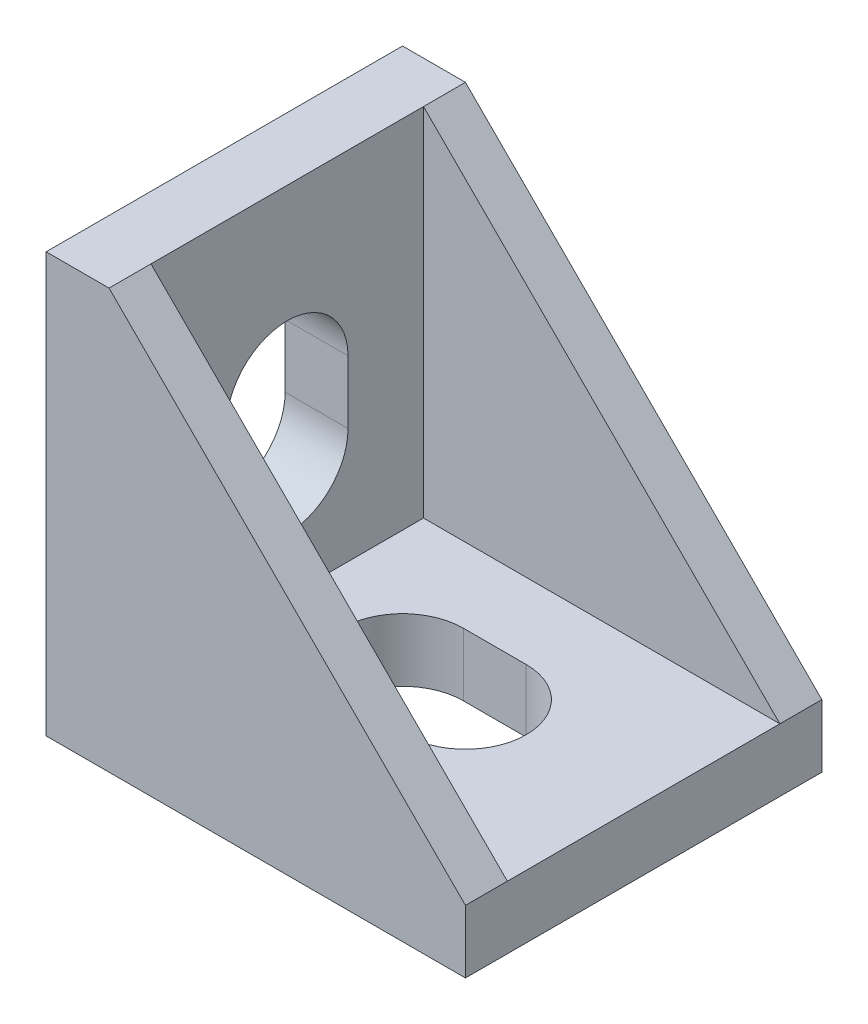
ISO-10303-21;
HEADER;
FILE_DESCRIPTION(('STEP AP214'),'2;1');
FILE_NAME('part.step','',(''),(''),'','','');
FILE_SCHEMA(('AUTOMOTIVE_DESIGN { 1 0 10303 214 1 1 1 1 }'));
ENDSEC;
DATA;
#1=APPLICATION_CONTEXT('core data for automotive mechanical design processes');
#2=APPLICATION_PROTOCOL_DEFINITION('international standard','automotive_design',2000,#1);
#3=PRODUCT_CONTEXT('',#1,'mechanical');
#4=PRODUCT('Part','Part','',(#3));
#5=PRODUCT_RELATED_PRODUCT_CATEGORY('part','',(#4));
#6=PRODUCT_DEFINITION_FORMATION('','',#4);
#7=PRODUCT_DEFINITION_CONTEXT('part definition',#1,'design');
#8=PRODUCT_DEFINITION('design','',#6,#7);
#9=PRODUCT_DEFINITION_SHAPE('','',#8);
#10=(LENGTH_UNIT() NAMED_UNIT(*) SI_UNIT(.MILLI.,.METRE.));
#11=(NAMED_UNIT(*) PLANE_ANGLE_UNIT() SI_UNIT($,.RADIAN.));
#12=(NAMED_UNIT(*) SI_UNIT($,.STERADIAN.) SOLID_ANGLE_UNIT());
#13=UNCERTAINTY_MEASURE_WITH_UNIT(LENGTH_MEASURE(1.E-05),#10,'distance_accuracy_value','');
#14=(GEOMETRIC_REPRESENTATION_CONTEXT(3) GLOBAL_UNCERTAINTY_ASSIGNED_CONTEXT((#13)) GLOBAL_UNIT_ASSIGNED_CONTEXT((#10,
#11,#12)) REPRESENTATION_CONTEXT('',''));
#15=CARTESIAN_POINT('',(0.,0.,0.));
#16=DIRECTION('',(0.,0.,1.));
#17=DIRECTION('',(1.,0.,0.));
#18=AXIS2_PLACEMENT_3D('',#15,#16,#17);
#19=CARTESIAN_POINT('',(0.,0.,8.5));
#20=DIRECTION('',(0.,1.,0.));
#21=DIRECTION('',(0.,0.,1.));
#22=AXIS2_PLACEMENT_3D('',#19,#20,#21);
#23=PLANE('',#22);
#24=DIRECTION('',(-1.,0.,0.));
#25=VECTOR('',#24,1.);
#26=CARTESIAN_POINT('',(1.5,0.,2.));
#27=LINE('',#26,#25);
#28=CARTESIAN_POINT('',(3.34999999999999,0.,2.));
#29=VERTEX_POINT('',#28);
#30=CARTESIAN_POINT('',(1.5,0.,2.));
#31=VERTEX_POINT('',#30);
#32=EDGE_CURVE('E293',#29,#31,#27,.T.);
#33=ORIENTED_EDGE('',*,*,#32,.F.);
#34=DIRECTION('',(0.,0.,-1.));
#35=VECTOR('',#34,1.);
#36=CARTESIAN_POINT('',(3.34999999999999,0.,2.));
#37=LINE('',#36,#35);
#38=CARTESIAN_POINT('',(3.34999999999999,0.,-2.));
#39=VERTEX_POINT('',#38);
#40=EDGE_CURVE('E304',#29,#39,#37,.T.);
#41=ORIENTED_EDGE('',*,*,#40,.T.);
#42=DIRECTION('',(-1.,0.,0.));
#43=VECTOR('',#42,1.);
#44=CARTESIAN_POINT('',(1.5,0.,-2.));
#45=LINE('',#44,#43);
#46=CARTESIAN_POINT('',(1.5,0.,-2.));
#47=VERTEX_POINT('',#46);
#48=EDGE_CURVE('E266',#39,#47,#45,.T.);
#49=ORIENTED_EDGE('',*,*,#48,.T.);
#50=DIRECTION('',(0.,0.,-1.));
#51=VECTOR('',#50,1.);
#52=CARTESIAN_POINT('',(1.5,0.,2.));
#53=LINE('',#52,#51);
#54=EDGE_CURVE('E60',#31,#47,#53,.T.);
#55=ORIENTED_EDGE('',*,*,#54,.F.);
#56=EDGE_LOOP('',(#33,#41,#49,#55));
#57=FACE_BOUND('',#56,.T.);
#58=DIRECTION('',(1.,0.,0.));
#59=VECTOR('',#58,1.);
#60=CARTESIAN_POINT('',(11.5,0.,2.9));
#61=LINE('',#60,#59);
#62=CARTESIAN_POINT('',(8.49999999999996,0.,2.9));
#63=VERTEX_POINT('',#62);
#64=CARTESIAN_POINT('',(11.5,0.,2.9));
#65=VERTEX_POINT('',#64);
#66=EDGE_CURVE('E405',#63,#65,#61,.T.);
#67=ORIENTED_EDGE('',*,*,#66,.T.);
#68=CARTESIAN_POINT('',(11.5,0.,0.));
#69=DIRECTION('',(0.,1.,0.));
#70=DIRECTION('',(-1.,0.,0.));
#71=AXIS2_PLACEMENT_3D('',#68,#69,#70);
#72=CIRCLE('',#71,2.9);
#73=CARTESIAN_POINT('',(11.5,0.,-2.9));
#74=VERTEX_POINT('',#73);
#75=EDGE_CURVE('E393',#65,#74,#72,.T.);
#76=ORIENTED_EDGE('',*,*,#75,.T.);
#77=DIRECTION('',(-1.,0.,0.));
#78=VECTOR('',#77,1.);
#79=CARTESIAN_POINT('',(11.5,0.,-2.9));
#80=LINE('',#79,#78);
#81=CARTESIAN_POINT('',(8.49999999999996,0.,-2.9));
#82=VERTEX_POINT('',#81);
#83=EDGE_CURVE('E396',#74,#82,#80,.T.);
#84=ORIENTED_EDGE('',*,*,#83,.T.);
#85=CARTESIAN_POINT('',(8.49999999999996,0.,0.));
#86=DIRECTION('',(0.,1.,0.));
#87=DIRECTION('',(-1.,0.,0.));
#88=AXIS2_PLACEMENT_3D('',#85,#86,#87);
#89=CIRCLE('',#88,2.9);
#90=EDGE_CURVE('E401',#82,#63,#89,.T.);
#91=ORIENTED_EDGE('',*,*,#90,.T.);
#92=EDGE_LOOP('',(#67,#76,#84,#91));
#93=FACE_BOUND('',#92,.T.);
#94=DIRECTION('',(1.,0.,0.));
#95=VECTOR('',#94,1.);
#96=CARTESIAN_POINT('',(0.,0.,-8.5));
#97=LINE('',#96,#95);
#98=CARTESIAN_POINT('',(0.,0.,-8.5));
#99=VERTEX_POINT('',#98);
#100=CARTESIAN_POINT('',(20.,0.,-8.5));
#101=VERTEX_POINT('',#100);
#102=EDGE_CURVE('E515',#99,#101,#97,.T.);
#103=ORIENTED_EDGE('',*,*,#102,.T.);
#104=DIRECTION('',(0.,0.,-1.));
#105=VECTOR('',#104,1.);
#106=CARTESIAN_POINT('',(20.,0.,8.5));
#107=LINE('',#106,#105);
#108=CARTESIAN_POINT('',(20.,0.,8.5));
#109=VERTEX_POINT('',#108);
#110=EDGE_CURVE('E531',#109,#101,#107,.T.);
#111=ORIENTED_EDGE('',*,*,#110,.F.);
#112=DIRECTION('',(1.,0.,0.));
#113=VECTOR('',#112,1.);
#114=CARTESIAN_POINT('',(0.,0.,8.5));
#115=LINE('',#114,#113);
#116=CARTESIAN_POINT('',(0.,0.,8.5));
#117=VERTEX_POINT('',#116);
#118=EDGE_CURVE('E502',#117,#109,#115,.T.);
#119=ORIENTED_EDGE('',*,*,#118,.F.);
#120=DIRECTION('',(0.,0.,-1.));
#121=VECTOR('',#120,1.);
#122=CARTESIAN_POINT('',(0.,0.,8.5));
#123=LINE('',#122,#121);
#124=EDGE_CURVE('E534',#117,#99,#123,.T.);
#125=ORIENTED_EDGE('',*,*,#124,.T.);
#126=EDGE_LOOP('',(#103,#111,#119,#125));
#127=FACE_BOUND('',#126,.T.);
#128=DIRECTION('',(-1.,0.,0.));
#129=VECTOR('',#128,1.);
#130=CARTESIAN_POINT('',(18.5,0.,2.));
#131=LINE('',#130,#129);
#132=CARTESIAN_POINT('',(18.5,0.,2.));
#133=VERTEX_POINT('',#132);
#134=CARTESIAN_POINT('',(16.65,0.,2.));
#135=VERTEX_POINT('',#134);
#136=EDGE_CURVE('E249',#133,#135,#131,.T.);
#137=ORIENTED_EDGE('',*,*,#136,.F.);
#138=DIRECTION('',(0.,0.,-1.));
#139=VECTOR('',#138,1.);
#140=CARTESIAN_POINT('',(18.5,0.,2.));
#141=LINE('',#140,#139);
#142=CARTESIAN_POINT('',(18.5,0.,-2.));
#143=VERTEX_POINT('',#142);
#144=EDGE_CURVE('E260',#133,#143,#141,.T.);
#145=ORIENTED_EDGE('',*,*,#144,.T.);
#146=DIRECTION('',(-1.,0.,0.));
#147=VECTOR('',#146,1.);
#148=CARTESIAN_POINT('',(18.5,0.,-2.));
#149=LINE('',#148,#147);
#150=CARTESIAN_POINT('',(16.65,0.,-2.));
#151=VERTEX_POINT('',#150);
#152=EDGE_CURVE('E281',#143,#151,#149,.T.);
#153=ORIENTED_EDGE('',*,*,#152,.T.);
#154=DIRECTION('',(0.,0.,-1.));
#155=VECTOR('',#154,1.);
#156=CARTESIAN_POINT('',(16.65,0.,2.));
#157=LINE('',#156,#155);
#158=EDGE_CURVE('E267',#135,#151,#157,.T.);
#159=ORIENTED_EDGE('',*,*,#158,.F.);
#160=EDGE_LOOP('',(#137,#145,#153,#159));
#161=FACE_BOUND('',#160,.T.);
#162=ADVANCED_FACE('F36',(#57,#93,#127,#161),#23,.F.);
#163=CARTESIAN_POINT('',(0.,20.,8.5));
#164=DIRECTION('',(1.,0.,0.));
#165=DIRECTION('',(0.,1.,0.));
#166=AXIS2_PLACEMENT_3D('',#163,#164,#165);
#167=PLANE('',#166);
#168=DIRECTION('',(0.,1.,0.));
#169=VECTOR('',#168,1.);
#170=CARTESIAN_POINT('',(0.,18.5,2.));
#171=LINE('',#170,#169);
#172=CARTESIAN_POINT('',(0.,16.65,2.));
#173=VERTEX_POINT('',#172);
#174=CARTESIAN_POINT('',(0.,18.5,2.));
#175=VERTEX_POINT('',#174);
#176=EDGE_CURVE('E359',#173,#175,#171,.T.);
#177=ORIENTED_EDGE('',*,*,#176,.F.);
#178=DIRECTION('',(0.,0.,-1.));
#179=VECTOR('',#178,1.);
#180=CARTESIAN_POINT('',(0.,16.65,2.));
#181=LINE('',#180,#179);
#182=CARTESIAN_POINT('',(0.,16.65,-2.));
#183=VERTEX_POINT('',#182);
#184=EDGE_CURVE('E371',#173,#183,#181,.T.);
#185=ORIENTED_EDGE('',*,*,#184,.T.);
#186=DIRECTION('',(0.,1.,0.));
#187=VECTOR('',#186,1.);
#188=CARTESIAN_POINT('',(0.,18.5,-2.));
#189=LINE('',#188,#187);
#190=CARTESIAN_POINT('',(0.,18.5,-2.));
#191=VERTEX_POINT('',#190);
#192=EDGE_CURVE('E358',#183,#191,#189,.T.);
#193=ORIENTED_EDGE('',*,*,#192,.T.);
#194=DIRECTION('',(0.,0.,-1.));
#195=VECTOR('',#194,1.);
#196=CARTESIAN_POINT('',(0.,18.5,2.));
#197=LINE('',#196,#195);
#198=EDGE_CURVE('E389',#175,#191,#197,.T.);
#199=ORIENTED_EDGE('',*,*,#198,.F.);
#200=EDGE_LOOP('',(#177,#185,#193,#199));
#201=FACE_BOUND('',#200,.T.);
#202=DIRECTION('',(0.,1.,0.));
#203=VECTOR('',#202,1.);
#204=CARTESIAN_POINT('',(0.,8.50000000000005,2.9));
#205=LINE('',#204,#203);
#206=CARTESIAN_POINT('',(0.,8.50000000000005,2.9));
#207=VERTEX_POINT('',#206);
#208=CARTESIAN_POINT('',(0.,11.5,2.9));
#209=VERTEX_POINT('',#208);
#210=EDGE_CURVE('E433',#207,#209,#205,.T.);
#211=ORIENTED_EDGE('',*,*,#210,.F.);
#212=CARTESIAN_POINT('',(0.,8.50000000000005,0.));
#213=DIRECTION('',(1.,0.,0.));
#214=DIRECTION('',(0.,1.,0.));
#215=AXIS2_PLACEMENT_3D('',#212,#213,#214);
#216=CIRCLE('',#215,2.9);
#217=CARTESIAN_POINT('',(0.,8.50000000000004,-2.9));
#218=VERTEX_POINT('',#217);
#219=EDGE_CURVE('E436',#218,#207,#216,.F.);
#220=ORIENTED_EDGE('',*,*,#219,.F.);
#221=DIRECTION('',(0.,-1.,0.));
#222=VECTOR('',#221,1.);
#223=CARTESIAN_POINT('',(0.,8.50000000000005,-2.9));
#224=LINE('',#223,#222);
#225=CARTESIAN_POINT('',(0.,11.5,-2.9));
#226=VERTEX_POINT('',#225);
#227=EDGE_CURVE('E457',#226,#218,#224,.T.);
#228=ORIENTED_EDGE('',*,*,#227,.F.);
#229=CARTESIAN_POINT('',(0.,11.5,0.));
#230=DIRECTION('',(1.,0.,0.));
#231=DIRECTION('',(0.,1.,0.));
#232=AXIS2_PLACEMENT_3D('',#229,#230,#231);
#233=CIRCLE('',#232,2.9);
#234=EDGE_CURVE('E423',#209,#226,#233,.F.);
#235=ORIENTED_EDGE('',*,*,#234,.F.);
#236=EDGE_LOOP('',(#211,#220,#228,#235));
#237=FACE_BOUND('',#236,.T.);
#238=DIRECTION('',(0.,-1.,0.));
#239=VECTOR('',#238,1.);
#240=CARTESIAN_POINT('',(0.,20.,-8.5));
#241=LINE('',#240,#239);
#242=CARTESIAN_POINT('',(0.,20.,-8.5));
#243=VERTEX_POINT('',#242);
#244=EDGE_CURVE('E512',#243,#99,#241,.T.);
#245=ORIENTED_EDGE('',*,*,#244,.T.);
#246=ORIENTED_EDGE('',*,*,#124,.F.);
#247=DIRECTION('',(0.,-1.,0.));
#248=VECTOR('',#247,1.);
#249=CARTESIAN_POINT('',(0.,20.,8.5));
#250=LINE('',#249,#248);
#251=CARTESIAN_POINT('',(0.,20.,8.5));
#252=VERTEX_POINT('',#251);
#253=EDGE_CURVE('E499',#252,#117,#250,.T.);
#254=ORIENTED_EDGE('',*,*,#253,.F.);
#255=DIRECTION('',(0.,0.,-1.));
#256=VECTOR('',#255,1.);
#257=CARTESIAN_POINT('',(0.,20.,8.5));
#258=LINE('',#257,#256);
#259=EDGE_CURVE('E538',#252,#243,#258,.T.);
#260=ORIENTED_EDGE('',*,*,#259,.T.);
#261=EDGE_LOOP('',(#245,#246,#254,#260));
#262=FACE_BOUND('',#261,.T.);
#263=DIRECTION('',(0.,1.,0.));
#264=VECTOR('',#263,1.);
#265=CARTESIAN_POINT('',(0.,1.5,2.));
#266=LINE('',#265,#264);
#267=CARTESIAN_POINT('',(0.,1.5,2.));
#268=VERTEX_POINT('',#267);
#269=CARTESIAN_POINT('',(0.,3.35,2.));
#270=VERTEX_POINT('',#269);
#271=EDGE_CURVE('E328',#268,#270,#266,.T.);
#272=ORIENTED_EDGE('',*,*,#271,.F.);
#273=DIRECTION('',(0.,0.,-1.));
#274=VECTOR('',#273,1.);
#275=CARTESIAN_POINT('',(0.,1.5,2.));
#276=LINE('',#275,#274);
#277=CARTESIAN_POINT('',(0.,1.5,-2.));
#278=VERTEX_POINT('',#277);
#279=EDGE_CURVE('E354',#268,#278,#276,.T.);
#280=ORIENTED_EDGE('',*,*,#279,.T.);
#281=DIRECTION('',(0.,1.,0.));
#282=VECTOR('',#281,1.);
#283=CARTESIAN_POINT('',(0.,1.5,-2.));
#284=LINE('',#283,#282);
#285=CARTESIAN_POINT('',(0.,3.35,-2.));
#286=VERTEX_POINT('',#285);
#287=EDGE_CURVE('E338',#278,#286,#284,.T.);
#288=ORIENTED_EDGE('',*,*,#287,.T.);
#289=DIRECTION('',(0.,0.,-1.));
#290=VECTOR('',#289,1.);
#291=CARTESIAN_POINT('',(0.,3.35,2.));
#292=LINE('',#291,#290);
#293=EDGE_CURVE('E350',#270,#286,#292,.T.);
#294=ORIENTED_EDGE('',*,*,#293,.F.);
#295=EDGE_LOOP('',(#272,#280,#288,#294));
#296=FACE_BOUND('',#295,.T.);
#297=ADVANCED_FACE('F598',(#201,#237,#262,#296),#167,.F.);
#298=CARTESIAN_POINT('',(20.,3.,8.5));
#299=DIRECTION('',(-0.707106781186547,-0.707106781186547,0.));
#300=DIRECTION('',(0.707106781186548,-0.707106781186548,0.));
#301=AXIS2_PLACEMENT_3D('',#298,#299,#300);
#302=PLANE('',#301);
#303=DIRECTION('',(0.,0.,-1.));
#304=VECTOR('',#303,1.);
#305=CARTESIAN_POINT('',(3.,20.,8.5));
#306=LINE('',#305,#304);
#307=CARTESIAN_POINT('',(3.,20.,-6.5));
#308=VERTEX_POINT('',#307);
#309=CARTESIAN_POINT('',(3.,20.,-8.5));
#310=VERTEX_POINT('',#309);
#311=EDGE_CURVE('E508',#308,#310,#306,.T.);
#312=ORIENTED_EDGE('',*,*,#311,.F.);
#313=DIRECTION('',(0.707106781186548,-0.707106781186548,0.));
#314=VECTOR('',#313,1.);
#315=CARTESIAN_POINT('',(20.,3.,-6.5));
#316=LINE('',#315,#314);
#317=CARTESIAN_POINT('',(20.,2.99999999999995,-6.5));
#318=VERTEX_POINT('',#317);
#319=EDGE_CURVE('E11',#308,#318,#316,.T.);
#320=ORIENTED_EDGE('',*,*,#319,.T.);
#321=DIRECTION('',(0.,0.,-1.));
#322=VECTOR('',#321,1.);
#323=CARTESIAN_POINT('',(20.,3.,8.5));
#324=LINE('',#323,#322);
#325=CARTESIAN_POINT('',(20.,3.,-8.5));
#326=VERTEX_POINT('',#325);
#327=EDGE_CURVE('E526',#318,#326,#324,.T.);
#328=ORIENTED_EDGE('',*,*,#327,.T.);
#329=DIRECTION('',(-0.707106781186548,0.707106781186548,0.));
#330=VECTOR('',#329,1.);
#331=CARTESIAN_POINT('',(20.,3.,-8.5));
#332=LINE('',#331,#330);
#333=EDGE_CURVE('E500',#326,#310,#332,.T.);
#334=ORIENTED_EDGE('',*,*,#333,.T.);
#335=EDGE_LOOP('',(#312,#320,#328,#334));
#336=FACE_BOUND('',#335,.T.);
#337=ADVANCED_FACE('F573',(#336),#302,.F.);
#338=CARTESIAN_POINT('',(3.,20.,8.5));
#339=DIRECTION('',(0.,-1.,0.));
#340=DIRECTION('',(1.,0.,0.));
#341=AXIS2_PLACEMENT_3D('',#338,#339,#340);
#342=PLANE('',#341);
#343=DIRECTION('',(-1.,0.,0.));
#344=VECTOR('',#343,1.);
#345=CARTESIAN_POINT('',(3.,20.,-8.5));
#346=LINE('',#345,#344);
#347=EDGE_CURVE('E492',#310,#243,#346,.T.);
#348=ORIENTED_EDGE('',*,*,#347,.T.);
#349=ORIENTED_EDGE('',*,*,#259,.F.);
#350=DIRECTION('',(-1.,0.,0.));
#351=VECTOR('',#350,1.);
#352=CARTESIAN_POINT('',(3.,20.,8.5));
#353=LINE('',#352,#351);
#354=CARTESIAN_POINT('',(3.,20.,8.5));
#355=VERTEX_POINT('',#354);
#356=EDGE_CURVE('E495',#355,#252,#353,.T.);
#357=ORIENTED_EDGE('',*,*,#356,.F.);
#358=CARTESIAN_POINT('',(3.,20.,6.5));
#359=VERTEX_POINT('',#358);
#360=EDGE_CURVE('E523',#355,#359,#306,.T.);
#361=ORIENTED_EDGE('',*,*,#360,.T.);
#362=DIRECTION('',(0.,0.,1.));
#363=VECTOR('',#362,1.);
#364=CARTESIAN_POINT('',(3.,20.,-6.5));
#365=LINE('',#364,#363);
#366=EDGE_CURVE('E470',#308,#359,#365,.T.);
#367=ORIENTED_EDGE('',*,*,#366,.F.);
#368=ORIENTED_EDGE('',*,*,#311,.T.);
#369=EDGE_LOOP('',(#348,#349,#357,#361,#367,#368));
#370=FACE_BOUND('',#369,.T.);
#371=ADVANCED_FACE('F38',(#370),#342,.F.);
#372=CARTESIAN_POINT('',(20.,0.,8.5));
#373=DIRECTION('',(-1.,0.,0.));
#374=DIRECTION('',(0.,-1.,0.));
#375=AXIS2_PLACEMENT_3D('',#372,#373,#374);
#376=PLANE('',#375);
#377=DIRECTION('',(0.,1.,0.));
#378=VECTOR('',#377,1.);
#379=CARTESIAN_POINT('',(20.,0.,-8.5));
#380=LINE('',#379,#378);
#381=EDGE_CURVE('E517',#101,#326,#380,.T.);
#382=ORIENTED_EDGE('',*,*,#381,.T.);
#383=ORIENTED_EDGE('',*,*,#327,.F.);
#384=DIRECTION('',(0.,0.,-1.));
#385=VECTOR('',#384,1.);
#386=CARTESIAN_POINT('',(20.,2.99999999999995,-6.5));
#387=LINE('',#386,#385);
#388=CARTESIAN_POINT('',(20.,2.99999999999995,6.5));
#389=VERTEX_POINT('',#388);
#390=EDGE_CURVE('E479',#389,#318,#387,.T.);
#391=ORIENTED_EDGE('',*,*,#390,.F.);
#392=CARTESIAN_POINT('',(20.,3.,8.5));
#393=VERTEX_POINT('',#392);
#394=EDGE_CURVE('E527',#393,#389,#324,.T.);
#395=ORIENTED_EDGE('',*,*,#394,.F.);
#396=DIRECTION('',(0.,1.,0.));
#397=VECTOR('',#396,1.);
#398=CARTESIAN_POINT('',(20.,0.,8.5));
#399=LINE('',#398,#397);
#400=EDGE_CURVE('E504',#109,#393,#399,.T.);
#401=ORIENTED_EDGE('',*,*,#400,.F.);
#402=ORIENTED_EDGE('',*,*,#110,.T.);
#403=EDGE_LOOP('',(#382,#383,#391,#395,#401,#402));
#404=FACE_BOUND('',#403,.T.);
#405=ADVANCED_FACE('F562',(#404),#376,.F.);
#406=ORIENTED_EDGE('',*,*,#394,.T.);
#407=DIRECTION('',(-0.707106781186548,0.707106781186548,0.));
#408=VECTOR('',#407,1.);
#409=CARTESIAN_POINT('',(20.,3.,6.5));
#410=LINE('',#409,#408);
#411=EDGE_CURVE('E45',#389,#359,#410,.T.);
#412=ORIENTED_EDGE('',*,*,#411,.T.);
#413=ORIENTED_EDGE('',*,*,#360,.F.);
#414=DIRECTION('',(-0.707106781186548,0.707106781186548,0.));
#415=VECTOR('',#414,1.);
#416=CARTESIAN_POINT('',(20.,3.,8.5));
#417=LINE('',#416,#415);
#418=EDGE_CURVE('E506',#393,#355,#417,.T.);
#419=ORIENTED_EDGE('',*,*,#418,.F.);
#420=EDGE_LOOP('',(#406,#412,#413,#419));
#421=FACE_BOUND('',#420,.T.);
#422=ADVANCED_FACE('F545',(#421),#302,.F.);
#423=CARTESIAN_POINT('',(0.,0.,8.5));
#424=DIRECTION('',(0.,0.,1.));
#425=DIRECTION('',(1.,0.,0.));
#426=AXIS2_PLACEMENT_3D('',#423,#424,#425);
#427=PLANE('',#426);
#428=ORIENTED_EDGE('',*,*,#356,.T.);
#429=ORIENTED_EDGE('',*,*,#253,.T.);
#430=ORIENTED_EDGE('',*,*,#118,.T.);
#431=ORIENTED_EDGE('',*,*,#400,.T.);
#432=ORIENTED_EDGE('',*,*,#418,.T.);
#433=EDGE_LOOP('',(#428,#429,#430,#431,#432));
#434=FACE_BOUND('',#433,.T.);
#435=ADVANCED_FACE('F555',(#434),#427,.T.);
#436=CARTESIAN_POINT('',(0.,0.,-8.5));
#437=DIRECTION('',(0.,0.,1.));
#438=DIRECTION('',(1.,0.,0.));
#439=AXIS2_PLACEMENT_3D('',#436,#437,#438);
#440=PLANE('',#439);
#441=ORIENTED_EDGE('',*,*,#347,.F.);
#442=ORIENTED_EDGE('',*,*,#333,.F.);
#443=ORIENTED_EDGE('',*,*,#381,.F.);
#444=ORIENTED_EDGE('',*,*,#102,.F.);
#445=ORIENTED_EDGE('',*,*,#244,.F.);
#446=EDGE_LOOP('',(#441,#442,#443,#444,#445));
#447=FACE_BOUND('',#446,.T.);
#448=ADVANCED_FACE('F646',(#447),#440,.F.);
#449=CARTESIAN_POINT('',(2.99999999999996,2.99999999999999,-6.5));
#450=DIRECTION('',(0.,0.,-1.));
#451=DIRECTION('',(-1.,0.,0.));
#452=AXIS2_PLACEMENT_3D('',#449,#450,#451);
#453=PLANE('',#452);
#454=DIRECTION('',(0.,1.,0.));
#455=VECTOR('',#454,1.);
#456=CARTESIAN_POINT('',(2.99999999999996,2.99999999999999,-6.5));
#457=LINE('',#456,#455);
#458=CARTESIAN_POINT('',(2.99999999999996,2.99999999999999,-6.5));
#459=VERTEX_POINT('',#458);
#460=EDGE_CURVE('E489',#459,#308,#457,.T.);
#461=ORIENTED_EDGE('',*,*,#460,.F.);
#462=DIRECTION('',(-1.,0.,0.));
#463=VECTOR('',#462,1.);
#464=CARTESIAN_POINT('',(2.99999999999996,2.99999999999999,-6.5));
#465=LINE('',#464,#463);
#466=EDGE_CURVE('E481',#318,#459,#465,.T.);
#467=ORIENTED_EDGE('',*,*,#466,.F.);
#468=ORIENTED_EDGE('',*,*,#319,.F.);
#469=EDGE_LOOP('',(#461,#467,#468));
#470=FACE_BOUND('',#469,.T.);
#471=ADVANCED_FACE('F569',(#470),#453,.F.);
#472=CARTESIAN_POINT('',(2.99999999999996,2.99999999999999,6.5));
#473=DIRECTION('',(0.,0.,1.));
#474=DIRECTION('',(1.,0.,0.));
#475=AXIS2_PLACEMENT_3D('',#472,#473,#474);
#476=PLANE('',#475);
#477=DIRECTION('',(1.,0.,0.));
#478=VECTOR('',#477,1.);
#479=CARTESIAN_POINT('',(2.99999999999996,2.99999999999999,6.5));
#480=LINE('',#479,#478);
#481=CARTESIAN_POINT('',(2.99999999999996,2.99999999999999,6.5));
#482=VERTEX_POINT('',#481);
#483=EDGE_CURVE('E475',#482,#389,#480,.T.);
#484=ORIENTED_EDGE('',*,*,#483,.F.);
#485=DIRECTION('',(0.,1.,0.));
#486=VECTOR('',#485,1.);
#487=CARTESIAN_POINT('',(2.99999999999996,2.99999999999999,6.5));
#488=LINE('',#487,#486);
#489=EDGE_CURVE('E485',#482,#359,#488,.T.);
#490=ORIENTED_EDGE('',*,*,#489,.T.);
#491=ORIENTED_EDGE('',*,*,#411,.F.);
#492=EDGE_LOOP('',(#484,#490,#491));
#493=FACE_BOUND('',#492,.T.);
#494=ADVANCED_FACE('F660',(#493),#476,.F.);
#495=CARTESIAN_POINT('',(2.99999999999996,2.99999999999999,-6.5));
#496=DIRECTION('',(-1.,0.,0.));
#497=DIRECTION('',(0.,-1.,0.));
#498=AXIS2_PLACEMENT_3D('',#495,#496,#497);
#499=PLANE('',#498);
#500=DIRECTION('',(0.,1.,0.));
#501=VECTOR('',#500,1.);
#502=CARTESIAN_POINT('',(2.99999999999998,8.50000000000004,-2.9));
#503=LINE('',#502,#501);
#504=CARTESIAN_POINT('',(2.99999999999998,8.50000000000004,-2.9));
#505=VERTEX_POINT('',#504);
#506=CARTESIAN_POINT('',(2.99999999999998,11.5,-2.9));
#507=VERTEX_POINT('',#506);
#508=EDGE_CURVE('E442',#505,#507,#503,.T.);
#509=ORIENTED_EDGE('',*,*,#508,.F.);
#510=CARTESIAN_POINT('',(2.99999999999998,8.50000000000004,0.));
#511=DIRECTION('',(1.,0.,0.));
#512=DIRECTION('',(0.,1.,0.));
#513=AXIS2_PLACEMENT_3D('',#510,#511,#512);
#514=CIRCLE('',#513,2.9);
#515=CARTESIAN_POINT('',(2.99999999999998,8.50000000000004,2.9));
#516=VERTEX_POINT('',#515);
#517=EDGE_CURVE('E440',#516,#505,#514,.T.);
#518=ORIENTED_EDGE('',*,*,#517,.F.);
#519=DIRECTION('',(0.,-1.,0.));
#520=VECTOR('',#519,1.);
#521=CARTESIAN_POINT('',(2.99999999999998,8.50000000000004,2.9));
#522=LINE('',#521,#520);
#523=CARTESIAN_POINT('',(2.99999999999998,11.5,2.9));
#524=VERTEX_POINT('',#523);
#525=EDGE_CURVE('E449',#524,#516,#522,.T.);
#526=ORIENTED_EDGE('',*,*,#525,.F.);
#527=CARTESIAN_POINT('',(2.99999999999998,11.5,0.));
#528=DIRECTION('',(1.,0.,0.));
#529=DIRECTION('',(0.,1.,0.));
#530=AXIS2_PLACEMENT_3D('',#527,#528,#529);
#531=CIRCLE('',#530,2.9);
#532=EDGE_CURVE('E445',#507,#524,#531,.T.);
#533=ORIENTED_EDGE('',*,*,#532,.F.);
#534=EDGE_LOOP('',(#509,#518,#526,#533));
#535=FACE_BOUND('',#534,.T.);
#536=ORIENTED_EDGE('',*,*,#366,.T.);
#537=ORIENTED_EDGE('',*,*,#489,.F.);
#538=DIRECTION('',(0.,0.,1.));
#539=VECTOR('',#538,1.);
#540=CARTESIAN_POINT('',(2.99999999999996,2.99999999999999,-6.5));
#541=LINE('',#540,#539);
#542=EDGE_CURVE('E471',#459,#482,#541,.T.);
#543=ORIENTED_EDGE('',*,*,#542,.F.);
#544=ORIENTED_EDGE('',*,*,#460,.T.);
#545=EDGE_LOOP('',(#536,#537,#543,#544));
#546=FACE_BOUND('',#545,.T.);
#547=ADVANCED_FACE('F667',(#535,#546),#499,.F.);
#548=CARTESIAN_POINT('',(0.,3.,0.));
#549=DIRECTION('',(0.,1.,0.));
#550=DIRECTION('',(-1.,0.,0.));
#551=AXIS2_PLACEMENT_3D('',#548,#549,#550);
#552=PLANE('',#551);
#553=CARTESIAN_POINT('',(11.5,2.99999999999997,0.));
#554=DIRECTION('',(0.,1.,0.));
#555=DIRECTION('',(-1.,0.,0.));
#556=AXIS2_PLACEMENT_3D('',#553,#554,#555);
#557=CIRCLE('',#556,2.9);
#558=CARTESIAN_POINT('',(11.5,2.99999999999997,2.9));
#559=VERTEX_POINT('',#558);
#560=CARTESIAN_POINT('',(11.5,2.99999999999997,-2.9));
#561=VERTEX_POINT('',#560);
#562=EDGE_CURVE('E392',#559,#561,#557,.T.);
#563=ORIENTED_EDGE('',*,*,#562,.F.);
#564=DIRECTION('',(1.,0.,0.));
#565=VECTOR('',#564,1.);
#566=CARTESIAN_POINT('',(11.5,2.99999999999997,2.9));
#567=LINE('',#566,#565);
#568=CARTESIAN_POINT('',(8.49999999999997,2.99999999999998,2.9));
#569=VERTEX_POINT('',#568);
#570=EDGE_CURVE('E397',#569,#559,#567,.T.);
#571=ORIENTED_EDGE('',*,*,#570,.F.);
#572=CARTESIAN_POINT('',(8.49999999999997,2.99999999999998,0.));
#573=DIRECTION('',(0.,1.,0.));
#574=DIRECTION('',(-1.,0.,0.));
#575=AXIS2_PLACEMENT_3D('',#572,#573,#574);
#576=CIRCLE('',#575,2.9);
#577=CARTESIAN_POINT('',(8.49999999999997,2.99999999999998,-2.9));
#578=VERTEX_POINT('',#577);
#579=EDGE_CURVE('E414',#578,#569,#576,.T.);
#580=ORIENTED_EDGE('',*,*,#579,.F.);
#581=DIRECTION('',(-1.,0.,0.));
#582=VECTOR('',#581,1.);
#583=CARTESIAN_POINT('',(11.5,2.99999999999997,-2.9));
#584=LINE('',#583,#582);
#585=EDGE_CURVE('E410',#561,#578,#584,.T.);
#586=ORIENTED_EDGE('',*,*,#585,.F.);
#587=EDGE_LOOP('',(#563,#571,#580,#586));
#588=FACE_BOUND('',#587,.T.);
#589=ORIENTED_EDGE('',*,*,#542,.T.);
#590=ORIENTED_EDGE('',*,*,#483,.T.);
#591=ORIENTED_EDGE('',*,*,#390,.T.);
#592=ORIENTED_EDGE('',*,*,#466,.T.);
#593=EDGE_LOOP('',(#589,#590,#591,#592));
#594=FACE_BOUND('',#593,.T.);
#595=ADVANCED_FACE('F566',(#588,#594),#552,.T.);
#596=CARTESIAN_POINT('',(-0.00100000000002789,8.50000000000005,0.));
#597=DIRECTION('',(1.,0.,0.));
#598=DIRECTION('',(0.,1.,0.));
#599=AXIS2_PLACEMENT_3D('',#596,#597,#598);
#600=CYLINDRICAL_SURFACE('',#599,2.9);
#601=ORIENTED_EDGE('',*,*,#219,.T.);
#602=DIRECTION('',(1.,0.,0.));
#603=VECTOR('',#602,1.);
#604=CARTESIAN_POINT('',(-0.00100000000002745,8.50000000000005,2.9));
#605=LINE('',#604,#603);
#606=EDGE_CURVE('E454',#207,#516,#605,.T.);
#607=ORIENTED_EDGE('',*,*,#606,.T.);
#608=ORIENTED_EDGE('',*,*,#517,.T.);
#609=DIRECTION('',(1.,0.,0.));
#610=VECTOR('',#609,1.);
#611=CARTESIAN_POINT('',(-0.00100000000002832,8.50000000000005,-2.9));
#612=LINE('',#611,#610);
#613=EDGE_CURVE('E453',#218,#505,#612,.T.);
#614=ORIENTED_EDGE('',*,*,#613,.F.);
#615=EDGE_LOOP('',(#601,#607,#608,#614));
#616=FACE_BOUND('',#615,.T.);
#617=ADVANCED_FACE('F681',(#616),#600,.F.);
#618=CARTESIAN_POINT('',(-0.00100000000002745,8.50000000000005,2.9));
#619=DIRECTION('',(0.,0.,1.));
#620=DIRECTION('',(0.,-1.,0.));
#621=AXIS2_PLACEMENT_3D('',#618,#619,#620);
#622=PLANE('',#621);
#623=ORIENTED_EDGE('',*,*,#210,.T.);
#624=DIRECTION('',(1.,0.,0.));
#625=VECTOR('',#624,1.);
#626=CARTESIAN_POINT('',(-0.00100000000002052,11.5,2.9));
#627=LINE('',#626,#625);
#628=EDGE_CURVE('E458',#209,#524,#627,.T.);
#629=ORIENTED_EDGE('',*,*,#628,.T.);
#630=ORIENTED_EDGE('',*,*,#525,.T.);
#631=ORIENTED_EDGE('',*,*,#606,.F.);
#632=EDGE_LOOP('',(#623,#629,#630,#631));
#633=FACE_BOUND('',#632,.T.);
#634=ADVANCED_FACE('F689',(#633),#622,.F.);
#635=CARTESIAN_POINT('',(-0.00100000000002095,11.5,0.));
#636=DIRECTION('',(1.,0.,0.));
#637=DIRECTION('',(0.,1.,0.));
#638=AXIS2_PLACEMENT_3D('',#635,#636,#637);
#639=CYLINDRICAL_SURFACE('',#638,2.9);
#640=ORIENTED_EDGE('',*,*,#234,.T.);
#641=DIRECTION('',(1.,0.,0.));
#642=VECTOR('',#641,1.);
#643=CARTESIAN_POINT('',(-0.00100000000002138,11.5,-2.9));
#644=LINE('',#643,#642);
#645=EDGE_CURVE('E461',#226,#507,#644,.T.);
#646=ORIENTED_EDGE('',*,*,#645,.T.);
#647=ORIENTED_EDGE('',*,*,#532,.T.);
#648=ORIENTED_EDGE('',*,*,#628,.F.);
#649=EDGE_LOOP('',(#640,#646,#647,#648));
#650=FACE_BOUND('',#649,.T.);
#651=ADVANCED_FACE('F697',(#650),#639,.F.);
#652=CARTESIAN_POINT('',(-0.00100000000002832,8.50000000000005,-2.9));
#653=DIRECTION('',(0.,0.,-1.));
#654=DIRECTION('',(0.,1.,0.));
#655=AXIS2_PLACEMENT_3D('',#652,#653,#654);
#656=PLANE('',#655);
#657=ORIENTED_EDGE('',*,*,#227,.T.);
#658=ORIENTED_EDGE('',*,*,#613,.T.);
#659=ORIENTED_EDGE('',*,*,#508,.T.);
#660=ORIENTED_EDGE('',*,*,#645,.F.);
#661=EDGE_LOOP('',(#657,#658,#659,#660));
#662=FACE_BOUND('',#661,.T.);
#663=ADVANCED_FACE('F706',(#662),#656,.F.);
#664=CARTESIAN_POINT('',(11.5,0.,0.));
#665=DIRECTION('',(0.,1.,0.));
#666=DIRECTION('',(-1.,0.,0.));
#667=AXIS2_PLACEMENT_3D('',#664,#665,#666);
#668=CYLINDRICAL_SURFACE('',#667,2.9);
#669=ORIENTED_EDGE('',*,*,#562,.T.);
#670=DIRECTION('',(0.,1.,0.));
#671=VECTOR('',#670,1.);
#672=CARTESIAN_POINT('',(11.5,0.,-2.9));
#673=LINE('',#672,#671);
#674=EDGE_CURVE('E408',#74,#561,#673,.T.);
#675=ORIENTED_EDGE('',*,*,#674,.F.);
#676=ORIENTED_EDGE('',*,*,#75,.F.);
#677=DIRECTION('',(0.,1.,0.));
#678=VECTOR('',#677,1.);
#679=CARTESIAN_POINT('',(11.5,0.,2.9));
#680=LINE('',#679,#678);
#681=EDGE_CURVE('E420',#65,#559,#680,.T.);
#682=ORIENTED_EDGE('',*,*,#681,.T.);
#683=EDGE_LOOP('',(#669,#675,#676,#682));
#684=FACE_BOUND('',#683,.T.);
#685=ADVANCED_FACE('F713',(#684),#668,.F.);
#686=CARTESIAN_POINT('',(11.5,0.,2.9));
#687=DIRECTION('',(0.,0.,1.));
#688=DIRECTION('',(1.,0.,0.));
#689=AXIS2_PLACEMENT_3D('',#686,#687,#688);
#690=PLANE('',#689);
#691=ORIENTED_EDGE('',*,*,#570,.T.);
#692=ORIENTED_EDGE('',*,*,#681,.F.);
#693=ORIENTED_EDGE('',*,*,#66,.F.);
#694=DIRECTION('',(0.,1.,0.));
#695=VECTOR('',#694,1.);
#696=CARTESIAN_POINT('',(8.49999999999996,0.,2.9));
#697=LINE('',#696,#695);
#698=EDGE_CURVE('E424',#63,#569,#697,.T.);
#699=ORIENTED_EDGE('',*,*,#698,.T.);
#700=EDGE_LOOP('',(#691,#692,#693,#699));
#701=FACE_BOUND('',#700,.T.);
#702=ADVANCED_FACE('F721',(#701),#690,.F.);
#703=CARTESIAN_POINT('',(8.49999999999996,0.,0.));
#704=DIRECTION('',(0.,1.,0.));
#705=DIRECTION('',(-1.,0.,0.));
#706=AXIS2_PLACEMENT_3D('',#703,#704,#705);
#707=CYLINDRICAL_SURFACE('',#706,2.9);
#708=ORIENTED_EDGE('',*,*,#579,.T.);
#709=ORIENTED_EDGE('',*,*,#698,.F.);
#710=ORIENTED_EDGE('',*,*,#90,.F.);
#711=DIRECTION('',(0.,1.,0.));
#712=VECTOR('',#711,1.);
#713=CARTESIAN_POINT('',(8.49999999999996,0.,-2.9));
#714=LINE('',#713,#712);
#715=EDGE_CURVE('E427',#82,#578,#714,.T.);
#716=ORIENTED_EDGE('',*,*,#715,.T.);
#717=EDGE_LOOP('',(#708,#709,#710,#716));
#718=FACE_BOUND('',#717,.T.);
#719=ADVANCED_FACE('F729',(#718),#707,.F.);
#720=CARTESIAN_POINT('',(11.5,0.,-2.9));
#721=DIRECTION('',(0.,0.,-1.));
#722=DIRECTION('',(-1.,0.,0.));
#723=AXIS2_PLACEMENT_3D('',#720,#721,#722);
#724=PLANE('',#723);
#725=ORIENTED_EDGE('',*,*,#585,.T.);
#726=ORIENTED_EDGE('',*,*,#715,.F.);
#727=ORIENTED_EDGE('',*,*,#83,.F.);
#728=ORIENTED_EDGE('',*,*,#674,.T.);
#729=EDGE_LOOP('',(#725,#726,#727,#728));
#730=FACE_BOUND('',#729,.T.);
#731=ADVANCED_FACE('F737',(#730),#724,.F.);
#732=CARTESIAN_POINT('',(0.,18.5,2.));
#733=DIRECTION('',(0.,-1.,0.));
#734=DIRECTION('',(1.,0.,0.));
#735=AXIS2_PLACEMENT_3D('',#732,#733,#734);
#736=PLANE('',#735);
#737=DIRECTION('',(-1.,0.,0.));
#738=VECTOR('',#737,1.);
#739=CARTESIAN_POINT('',(0.,18.5,-2.));
#740=LINE('',#739,#738);
#741=CARTESIAN_POINT('',(-1.,18.5,-2.));
#742=VERTEX_POINT('',#741);
#743=EDGE_CURVE('E374',#191,#742,#740,.T.);
#744=ORIENTED_EDGE('',*,*,#743,.T.);
#745=DIRECTION('',(0.,0.,-1.));
#746=VECTOR('',#745,1.);
#747=CARTESIAN_POINT('',(-1.,18.5,2.));
#748=LINE('',#747,#746);
#749=CARTESIAN_POINT('',(-1.,18.5,2.));
#750=VERTEX_POINT('',#749);
#751=EDGE_CURVE('E385',#750,#742,#748,.T.);
#752=ORIENTED_EDGE('',*,*,#751,.F.);
#753=DIRECTION('',(-1.,0.,0.));
#754=VECTOR('',#753,1.);
#755=CARTESIAN_POINT('',(0.,18.5,2.));
#756=LINE('',#755,#754);
#757=EDGE_CURVE('E362',#175,#750,#756,.T.);
#758=ORIENTED_EDGE('',*,*,#757,.F.);
#759=ORIENTED_EDGE('',*,*,#198,.T.);
#760=EDGE_LOOP('',(#744,#752,#758,#759));
#761=FACE_BOUND('',#760,.T.);
#762=ADVANCED_FACE('F744',(#761),#736,.F.);
#763=CARTESIAN_POINT('',(-1.,18.5,2.));
#764=DIRECTION('',(1.,0.,0.));
#765=DIRECTION('',(0.,1.,0.));
#766=AXIS2_PLACEMENT_3D('',#763,#764,#765);
#767=PLANE('',#766);
#768=DIRECTION('',(0.,-1.,0.));
#769=VECTOR('',#768,1.);
#770=CARTESIAN_POINT('',(-1.,18.5,-2.));
#771=LINE('',#770,#769);
#772=CARTESIAN_POINT('',(-1.,16.65,-2.));
#773=VERTEX_POINT('',#772);
#774=EDGE_CURVE('E376',#742,#773,#771,.T.);
#775=ORIENTED_EDGE('',*,*,#774,.T.);
#776=DIRECTION('',(0.,0.,-1.));
#777=VECTOR('',#776,1.);
#778=CARTESIAN_POINT('',(-1.,16.65,2.));
#779=LINE('',#778,#777);
#780=CARTESIAN_POINT('',(-1.,16.65,2.));
#781=VERTEX_POINT('',#780);
#782=EDGE_CURVE('E381',#781,#773,#779,.T.);
#783=ORIENTED_EDGE('',*,*,#782,.F.);
#784=DIRECTION('',(0.,-1.,0.));
#785=VECTOR('',#784,1.);
#786=CARTESIAN_POINT('',(-1.,18.5,2.));
#787=LINE('',#786,#785);
#788=EDGE_CURVE('E365',#750,#781,#787,.T.);
#789=ORIENTED_EDGE('',*,*,#788,.F.);
#790=ORIENTED_EDGE('',*,*,#751,.T.);
#791=EDGE_LOOP('',(#775,#783,#789,#790));
#792=FACE_BOUND('',#791,.T.);
#793=ADVANCED_FACE('F751',(#792),#767,.F.);
#794=CARTESIAN_POINT('',(0.,16.65,2.));
#795=DIRECTION('',(0.,1.,0.));
#796=DIRECTION('',(0.,0.,1.));
#797=AXIS2_PLACEMENT_3D('',#794,#795,#796);
#798=PLANE('',#797);
#799=DIRECTION('',(1.,0.,0.));
#800=VECTOR('',#799,1.);
#801=CARTESIAN_POINT('',(0.,16.65,-2.));
#802=LINE('',#801,#800);
#803=EDGE_CURVE('E363',#773,#183,#802,.T.);
#804=ORIENTED_EDGE('',*,*,#803,.T.);
#805=ORIENTED_EDGE('',*,*,#184,.F.);
#806=DIRECTION('',(1.,0.,0.));
#807=VECTOR('',#806,1.);
#808=CARTESIAN_POINT('',(0.,16.65,2.));
#809=LINE('',#808,#807);
#810=EDGE_CURVE('E368',#781,#173,#809,.T.);
#811=ORIENTED_EDGE('',*,*,#810,.F.);
#812=ORIENTED_EDGE('',*,*,#782,.T.);
#813=EDGE_LOOP('',(#804,#805,#811,#812));
#814=FACE_BOUND('',#813,.T.);
#815=ADVANCED_FACE('F759',(#814),#798,.F.);
#816=CARTESIAN_POINT('',(0.,0.,2.));
#817=DIRECTION('',(0.,0.,-1.));
#818=DIRECTION('',(-1.,0.,0.));
#819=AXIS2_PLACEMENT_3D('',#816,#817,#818);
#820=PLANE('',#819);
#821=ORIENTED_EDGE('',*,*,#176,.T.);
#822=ORIENTED_EDGE('',*,*,#757,.T.);
#823=ORIENTED_EDGE('',*,*,#788,.T.);
#824=ORIENTED_EDGE('',*,*,#810,.T.);
#825=EDGE_LOOP('',(#821,#822,#823,#824));
#826=FACE_BOUND('',#825,.T.);
#827=ADVANCED_FACE('F767',(#826),#820,.F.);
#828=CARTESIAN_POINT('',(0.,0.,-2.));
#829=DIRECTION('',(0.,0.,-1.));
#830=DIRECTION('',(-1.,0.,0.));
#831=AXIS2_PLACEMENT_3D('',#828,#829,#830);
#832=PLANE('',#831);
#833=ORIENTED_EDGE('',*,*,#192,.F.);
#834=ORIENTED_EDGE('',*,*,#803,.F.);
#835=ORIENTED_EDGE('',*,*,#774,.F.);
#836=ORIENTED_EDGE('',*,*,#743,.F.);
#837=EDGE_LOOP('',(#833,#834,#835,#836));
#838=FACE_BOUND('',#837,.T.);
#839=ADVANCED_FACE('F775',(#838),#832,.T.);
#840=CARTESIAN_POINT('',(0.,1.5,2.));
#841=DIRECTION('',(0.,1.,0.));
#842=DIRECTION('',(-1.,0.,0.));
#843=AXIS2_PLACEMENT_3D('',#840,#841,#842);
#844=PLANE('',#843);
#845=DIRECTION('',(1.,0.,0.));
#846=VECTOR('',#845,1.);
#847=CARTESIAN_POINT('',(0.,1.5,-2.));
#848=LINE('',#847,#846);
#849=CARTESIAN_POINT('',(-0.999999999999998,1.49999999999999,-2.));
#850=VERTEX_POINT('',#849);
#851=EDGE_CURVE('E325',#850,#278,#848,.T.);
#852=ORIENTED_EDGE('',*,*,#851,.T.);
#853=ORIENTED_EDGE('',*,*,#279,.F.);
#854=DIRECTION('',(1.,0.,0.));
#855=VECTOR('',#854,1.);
#856=CARTESIAN_POINT('',(0.,1.5,2.));
#857=LINE('',#856,#855);
#858=CARTESIAN_POINT('',(-0.999999999999998,1.49999999999999,2.));
#859=VERTEX_POINT('',#858);
#860=EDGE_CURVE('E326',#859,#268,#857,.T.);
#861=ORIENTED_EDGE('',*,*,#860,.F.);
#862=DIRECTION('',(0.,0.,-1.));
#863=VECTOR('',#862,1.);
#864=CARTESIAN_POINT('',(-0.999999999999998,1.49999999999999,2.));
#865=LINE('',#864,#863);
#866=EDGE_CURVE('E335',#859,#850,#865,.T.);
#867=ORIENTED_EDGE('',*,*,#866,.T.);
#868=EDGE_LOOP('',(#852,#853,#861,#867));
#869=FACE_BOUND('',#868,.T.);
#870=ADVANCED_FACE('F783',(#869),#844,.F.);
#871=CARTESIAN_POINT('',(0.,3.35,2.));
#872=DIRECTION('',(0.,-1.,0.));
#873=DIRECTION('',(0.,0.,-1.));
#874=AXIS2_PLACEMENT_3D('',#871,#872,#873);
#875=PLANE('',#874);
#876=DIRECTION('',(-1.,0.,0.));
#877=VECTOR('',#876,1.);
#878=CARTESIAN_POINT('',(0.,3.35,-2.));
#879=LINE('',#878,#877);
#880=CARTESIAN_POINT('',(-0.999999999999998,3.35,-2.));
#881=VERTEX_POINT('',#880);
#882=EDGE_CURVE('E341',#286,#881,#879,.T.);
#883=ORIENTED_EDGE('',*,*,#882,.T.);
#884=DIRECTION('',(0.,0.,-1.));
#885=VECTOR('',#884,1.);
#886=CARTESIAN_POINT('',(-0.999999999999998,3.35,2.));
#887=LINE('',#886,#885);
#888=CARTESIAN_POINT('',(-0.999999999999998,3.35,2.));
#889=VERTEX_POINT('',#888);
#890=EDGE_CURVE('E346',#889,#881,#887,.T.);
#891=ORIENTED_EDGE('',*,*,#890,.F.);
#892=DIRECTION('',(-1.,0.,0.));
#893=VECTOR('',#892,1.);
#894=CARTESIAN_POINT('',(0.,3.35,2.));
#895=LINE('',#894,#893);
#896=EDGE_CURVE('E331',#270,#889,#895,.T.);
#897=ORIENTED_EDGE('',*,*,#896,.F.);
#898=ORIENTED_EDGE('',*,*,#293,.T.);
#899=EDGE_LOOP('',(#883,#891,#897,#898));
#900=FACE_BOUND('',#899,.T.);
#901=ADVANCED_FACE('F791',(#900),#875,.F.);
#902=CARTESIAN_POINT('',(-0.999999999999998,1.49999999999999,2.));
#903=DIRECTION('',(1.,0.,0.));
#904=DIRECTION('',(0.,1.,0.));
#905=AXIS2_PLACEMENT_3D('',#902,#903,#904);
#906=PLANE('',#905);
#907=DIRECTION('',(0.,-1.,0.));
#908=VECTOR('',#907,1.);
#909=CARTESIAN_POINT('',(-0.999999999999998,1.49999999999999,-2.));
#910=LINE('',#909,#908);
#911=EDGE_CURVE('E329',#881,#850,#910,.T.);
#912=ORIENTED_EDGE('',*,*,#911,.T.);
#913=ORIENTED_EDGE('',*,*,#866,.F.);
#914=DIRECTION('',(0.,-1.,0.));
#915=VECTOR('',#914,1.);
#916=CARTESIAN_POINT('',(-0.999999999999998,1.49999999999999,2.));
#917=LINE('',#916,#915);
#918=EDGE_CURVE('E333',#889,#859,#917,.T.);
#919=ORIENTED_EDGE('',*,*,#918,.F.);
#920=ORIENTED_EDGE('',*,*,#890,.T.);
#921=EDGE_LOOP('',(#912,#913,#919,#920));
#922=FACE_BOUND('',#921,.T.);
#923=ADVANCED_FACE('F799',(#922),#906,.F.);
#924=CARTESIAN_POINT('',(0.,0.,2.));
#925=DIRECTION('',(0.,0.,-1.));
#926=DIRECTION('',(-1.,0.,0.));
#927=AXIS2_PLACEMENT_3D('',#924,#925,#926);
#928=PLANE('',#927);
#929=ORIENTED_EDGE('',*,*,#860,.T.);
#930=ORIENTED_EDGE('',*,*,#271,.T.);
#931=ORIENTED_EDGE('',*,*,#896,.T.);
#932=ORIENTED_EDGE('',*,*,#918,.T.);
#933=EDGE_LOOP('',(#929,#930,#931,#932));
#934=FACE_BOUND('',#933,.T.);
#935=ADVANCED_FACE('F807',(#934),#928,.F.);
#936=CARTESIAN_POINT('',(0.,0.,-2.));
#937=DIRECTION('',(0.,0.,-1.));
#938=DIRECTION('',(-1.,0.,0.));
#939=AXIS2_PLACEMENT_3D('',#936,#937,#938);
#940=PLANE('',#939);
#941=ORIENTED_EDGE('',*,*,#851,.F.);
#942=ORIENTED_EDGE('',*,*,#911,.F.);
#943=ORIENTED_EDGE('',*,*,#882,.F.);
#944=ORIENTED_EDGE('',*,*,#287,.F.);
#945=EDGE_LOOP('',(#941,#942,#943,#944));
#946=FACE_BOUND('',#945,.T.);
#947=ADVANCED_FACE('F815',(#946),#940,.T.);
#948=CARTESIAN_POINT('',(1.5,0.,2.));
#949=DIRECTION('',(1.,0.,0.));
#950=DIRECTION('',(0.,1.,0.));
#951=AXIS2_PLACEMENT_3D('',#948,#949,#950);
#952=PLANE('',#951);
#953=DIRECTION('',(0.,-1.,0.));
#954=VECTOR('',#953,1.);
#955=CARTESIAN_POINT('',(1.5,0.,-2.));
#956=LINE('',#955,#954);
#957=CARTESIAN_POINT('',(1.5,-0.999999999999991,-2.));
#958=VERTEX_POINT('',#957);
#959=EDGE_CURVE('E307',#47,#958,#956,.T.);
#960=ORIENTED_EDGE('',*,*,#959,.T.);
#961=DIRECTION('',(0.,0.,-1.));
#962=VECTOR('',#961,1.);
#963=CARTESIAN_POINT('',(1.5,-0.999999999999991,2.));
#964=LINE('',#963,#962);
#965=CARTESIAN_POINT('',(1.5,-0.999999999999991,2.));
#966=VERTEX_POINT('',#965);
#967=EDGE_CURVE('E321',#966,#958,#964,.T.);
#968=ORIENTED_EDGE('',*,*,#967,.F.);
#969=DIRECTION('',(0.,-1.,0.));
#970=VECTOR('',#969,1.);
#971=CARTESIAN_POINT('',(1.5,0.,2.));
#972=LINE('',#971,#970);
#973=EDGE_CURVE('E296',#31,#966,#972,.T.);
#974=ORIENTED_EDGE('',*,*,#973,.F.);
#975=ORIENTED_EDGE('',*,*,#54,.T.);
#976=EDGE_LOOP('',(#960,#968,#974,#975));
#977=FACE_BOUND('',#976,.T.);
#978=ADVANCED_FACE('F823',(#977),#952,.F.);
#979=CARTESIAN_POINT('',(1.5,-0.999999999999991,2.));
#980=DIRECTION('',(0.,1.,0.));
#981=DIRECTION('',(-1.,0.,0.));
#982=AXIS2_PLACEMENT_3D('',#979,#980,#981);
#983=PLANE('',#982);
#984=DIRECTION('',(1.,0.,0.));
#985=VECTOR('',#984,1.);
#986=CARTESIAN_POINT('',(1.5,-0.999999999999991,-2.));
#987=LINE('',#986,#985);
#988=CARTESIAN_POINT('',(3.35,-0.999999999999984,-2.));
#989=VERTEX_POINT('',#988);
#990=EDGE_CURVE('E309',#958,#989,#987,.T.);
#991=ORIENTED_EDGE('',*,*,#990,.T.);
#992=DIRECTION('',(0.,0.,-1.));
#993=VECTOR('',#992,1.);
#994=CARTESIAN_POINT('',(3.35,-0.999999999999984,2.));
#995=LINE('',#994,#993);
#996=CARTESIAN_POINT('',(3.35,-0.999999999999984,2.));
#997=VERTEX_POINT('',#996);
#998=EDGE_CURVE('E317',#997,#989,#995,.T.);
#999=ORIENTED_EDGE('',*,*,#998,.F.);
#1000=DIRECTION('',(1.,0.,0.));
#1001=VECTOR('',#1000,1.);
#1002=CARTESIAN_POINT('',(1.5,-0.999999999999991,2.));
#1003=LINE('',#1002,#1001);
#1004=EDGE_CURVE('E299',#966,#997,#1003,.T.);
#1005=ORIENTED_EDGE('',*,*,#1004,.F.);
#1006=ORIENTED_EDGE('',*,*,#967,.T.);
#1007=EDGE_LOOP('',(#991,#999,#1005,#1006));
#1008=FACE_BOUND('',#1007,.T.);
#1009=ADVANCED_FACE('F831',(#1008),#983,.F.);
#1010=CARTESIAN_POINT('',(3.34999999999999,0.,2.));
#1011=DIRECTION('',(-1.,0.,0.));
#1012=DIRECTION('',(0.,-1.,0.));
#1013=AXIS2_PLACEMENT_3D('',#1010,#1011,#1012);
#1014=PLANE('',#1013);
#1015=DIRECTION('',(0.,1.,0.));
#1016=VECTOR('',#1015,1.);
#1017=CARTESIAN_POINT('',(3.34999999999999,0.,-2.));
#1018=LINE('',#1017,#1016);
#1019=EDGE_CURVE('E297',#989,#39,#1018,.T.);
#1020=ORIENTED_EDGE('',*,*,#1019,.T.);
#1021=ORIENTED_EDGE('',*,*,#40,.F.);
#1022=DIRECTION('',(0.,1.,0.));
#1023=VECTOR('',#1022,1.);
#1024=CARTESIAN_POINT('',(3.34999999999999,0.,2.));
#1025=LINE('',#1024,#1023);
#1026=EDGE_CURVE('E302',#997,#29,#1025,.T.);
#1027=ORIENTED_EDGE('',*,*,#1026,.F.);
#1028=ORIENTED_EDGE('',*,*,#998,.T.);
#1029=EDGE_LOOP('',(#1020,#1021,#1027,#1028));
#1030=FACE_BOUND('',#1029,.T.);
#1031=ADVANCED_FACE('F838',(#1030),#1014,.F.);
#1032=CARTESIAN_POINT('',(0.,0.,2.));
#1033=DIRECTION('',(0.,0.,-1.));
#1034=DIRECTION('',(-1.,0.,0.));
#1035=AXIS2_PLACEMENT_3D('',#1032,#1033,#1034);
#1036=PLANE('',#1035);
#1037=ORIENTED_EDGE('',*,*,#32,.T.);
#1038=ORIENTED_EDGE('',*,*,#973,.T.);
#1039=ORIENTED_EDGE('',*,*,#1004,.T.);
#1040=ORIENTED_EDGE('',*,*,#1026,.T.);
#1041=EDGE_LOOP('',(#1037,#1038,#1039,#1040));
#1042=FACE_BOUND('',#1041,.T.);
#1043=ADVANCED_FACE('F846',(#1042),#1036,.F.);
#1044=CARTESIAN_POINT('',(0.,0.,-2.));
#1045=DIRECTION('',(0.,0.,-1.));
#1046=DIRECTION('',(-1.,0.,0.));
#1047=AXIS2_PLACEMENT_3D('',#1044,#1045,#1046);
#1048=PLANE('',#1047);
#1049=ORIENTED_EDGE('',*,*,#48,.F.);
#1050=ORIENTED_EDGE('',*,*,#1019,.F.);
#1051=ORIENTED_EDGE('',*,*,#990,.F.);
#1052=ORIENTED_EDGE('',*,*,#959,.F.);
#1053=EDGE_LOOP('',(#1049,#1050,#1051,#1052));
#1054=FACE_BOUND('',#1053,.T.);
#1055=ADVANCED_FACE('F854',(#1054),#1048,.T.);
#1056=CARTESIAN_POINT('',(18.5,0.,2.));
#1057=DIRECTION('',(-1.,0.,0.));
#1058=DIRECTION('',(0.,-1.,0.));
#1059=AXIS2_PLACEMENT_3D('',#1056,#1057,#1058);
#1060=PLANE('',#1059);
#1061=DIRECTION('',(0.,1.,0.));
#1062=VECTOR('',#1061,1.);
#1063=CARTESIAN_POINT('',(18.5,0.,-2.));
#1064=LINE('',#1063,#1062);
#1065=CARTESIAN_POINT('',(18.5,-0.999999999999928,-2.));
#1066=VERTEX_POINT('',#1065);
#1067=EDGE_CURVE('E263',#1066,#143,#1064,.T.);
#1068=ORIENTED_EDGE('',*,*,#1067,.T.);
#1069=ORIENTED_EDGE('',*,*,#144,.F.);
#1070=DIRECTION('',(0.,1.,0.));
#1071=VECTOR('',#1070,1.);
#1072=CARTESIAN_POINT('',(18.5,0.,2.));
#1073=LINE('',#1072,#1071);
#1074=CARTESIAN_POINT('',(18.5,-0.999999999999928,2.));
#1075=VERTEX_POINT('',#1074);
#1076=EDGE_CURVE('E245',#1075,#133,#1073,.T.);
#1077=ORIENTED_EDGE('',*,*,#1076,.F.);
#1078=DIRECTION('',(0.,0.,-1.));
#1079=VECTOR('',#1078,1.);
#1080=CARTESIAN_POINT('',(18.5,-0.999999999999928,2.));
#1081=LINE('',#1080,#1079);
#1082=EDGE_CURVE('E279',#1075,#1066,#1081,.T.);
#1083=ORIENTED_EDGE('',*,*,#1082,.T.);
#1084=EDGE_LOOP('',(#1068,#1069,#1077,#1083));
#1085=FACE_BOUND('',#1084,.T.);
#1086=ADVANCED_FACE('F261',(#1085),#1060,.F.);
#1087=CARTESIAN_POINT('',(16.65,0.,2.));
#1088=DIRECTION('',(1.,0.,0.));
#1089=DIRECTION('',(0.,1.,0.));
#1090=AXIS2_PLACEMENT_3D('',#1087,#1088,#1089);
#1091=PLANE('',#1090);
#1092=DIRECTION('',(0.,-1.,0.));
#1093=VECTOR('',#1092,1.);
#1094=CARTESIAN_POINT('',(16.65,0.,-2.));
#1095=LINE('',#1094,#1093);
#1096=CARTESIAN_POINT('',(16.65,-0.999999999999935,-2.));
#1097=VERTEX_POINT('',#1096);
#1098=EDGE_CURVE('E52',#151,#1097,#1095,.T.);
#1099=ORIENTED_EDGE('',*,*,#1098,.T.);
#1100=DIRECTION('',(0.,0.,-1.));
#1101=VECTOR('',#1100,1.);
#1102=CARTESIAN_POINT('',(16.65,-0.999999999999935,2.));
#1103=LINE('',#1102,#1101);
#1104=CARTESIAN_POINT('',(16.65,-0.999999999999935,2.));
#1105=VERTEX_POINT('',#1104);
#1106=EDGE_CURVE('E287',#1105,#1097,#1103,.T.);
#1107=ORIENTED_EDGE('',*,*,#1106,.F.);
#1108=DIRECTION('',(0.,-1.,0.));
#1109=VECTOR('',#1108,1.);
#1110=CARTESIAN_POINT('',(16.65,0.,2.));
#1111=LINE('',#1110,#1109);
#1112=EDGE_CURVE('E271',#135,#1105,#1111,.T.);
#1113=ORIENTED_EDGE('',*,*,#1112,.F.);
#1114=ORIENTED_EDGE('',*,*,#158,.T.);
#1115=EDGE_LOOP('',(#1099,#1107,#1113,#1114));
#1116=FACE_BOUND('',#1115,.T.);
#1117=ADVANCED_FACE('F869',(#1116),#1091,.F.);
#1118=CARTESIAN_POINT('',(18.5,-0.999999999999928,2.));
#1119=DIRECTION('',(0.,1.,0.));
#1120=DIRECTION('',(-1.,0.,0.));
#1121=AXIS2_PLACEMENT_3D('',#1118,#1119,#1120);
#1122=PLANE('',#1121);
#1123=DIRECTION('',(1.,0.,0.));
#1124=VECTOR('',#1123,1.);
#1125=CARTESIAN_POINT('',(18.5,-0.999999999999928,-2.));
#1126=LINE('',#1125,#1124);
#1127=EDGE_CURVE('E256',#1097,#1066,#1126,.T.);
#1128=ORIENTED_EDGE('',*,*,#1127,.T.);
#1129=ORIENTED_EDGE('',*,*,#1082,.F.);
#1130=DIRECTION('',(1.,0.,0.));
#1131=VECTOR('',#1130,1.);
#1132=CARTESIAN_POINT('',(18.5,-0.999999999999928,2.));
#1133=LINE('',#1132,#1131);
#1134=EDGE_CURVE('E252',#1105,#1075,#1133,.T.);
#1135=ORIENTED_EDGE('',*,*,#1134,.F.);
#1136=ORIENTED_EDGE('',*,*,#1106,.T.);
#1137=EDGE_LOOP('',(#1128,#1129,#1135,#1136));
#1138=FACE_BOUND('',#1137,.T.);
#1139=ADVANCED_FACE('F876',(#1138),#1122,.F.);
#1140=CARTESIAN_POINT('',(0.,0.,2.));
#1141=DIRECTION('',(0.,0.,-1.));
#1142=DIRECTION('',(-1.,0.,0.));
#1143=AXIS2_PLACEMENT_3D('',#1140,#1141,#1142);
#1144=PLANE('',#1143);
#1145=ORIENTED_EDGE('',*,*,#1076,.T.);
#1146=ORIENTED_EDGE('',*,*,#136,.T.);
#1147=ORIENTED_EDGE('',*,*,#1112,.T.);
#1148=ORIENTED_EDGE('',*,*,#1134,.T.);
#1149=EDGE_LOOP('',(#1145,#1146,#1147,#1148));
#1150=FACE_BOUND('',#1149,.T.);
#1151=ADVANCED_FACE('F247',(#1150),#1144,.F.);
#1152=CARTESIAN_POINT('',(0.,0.,-2.));
#1153=DIRECTION('',(0.,0.,-1.));
#1154=DIRECTION('',(-1.,0.,0.));
#1155=AXIS2_PLACEMENT_3D('',#1152,#1153,#1154);
#1156=PLANE('',#1155);
#1157=ORIENTED_EDGE('',*,*,#1067,.F.);
#1158=ORIENTED_EDGE('',*,*,#1127,.F.);
#1159=ORIENTED_EDGE('',*,*,#1098,.F.);
#1160=ORIENTED_EDGE('',*,*,#152,.F.);
#1161=EDGE_LOOP('',(#1157,#1158,#1159,#1160));
#1162=FACE_BOUND('',#1161,.T.);
#1163=ADVANCED_FACE('F891',(#1162),#1156,.T.);
#1164=CLOSED_SHELL('',(#162,#297,#337,#371,#405,#422,#435,#448,#471,#494,#547,#595,#617,#634,
#651,#663,#685,#702,#719,#731,#762,#793,#815,#827,#839,#870,#901,#923,#935,#947,#978,#1009,
#1031,#1043,#1055,#1086,#1117,#1139,#1151,#1163));
#1165=MANIFOLD_SOLID_BREP('B2',#1164);
#1166=ADVANCED_BREP_SHAPE_REPRESENTATION('',(#18,#1165),#14);
#1167=SHAPE_DEFINITION_REPRESENTATION(#9,#1166);
ENDSEC;
END-ISO-10303-21;
